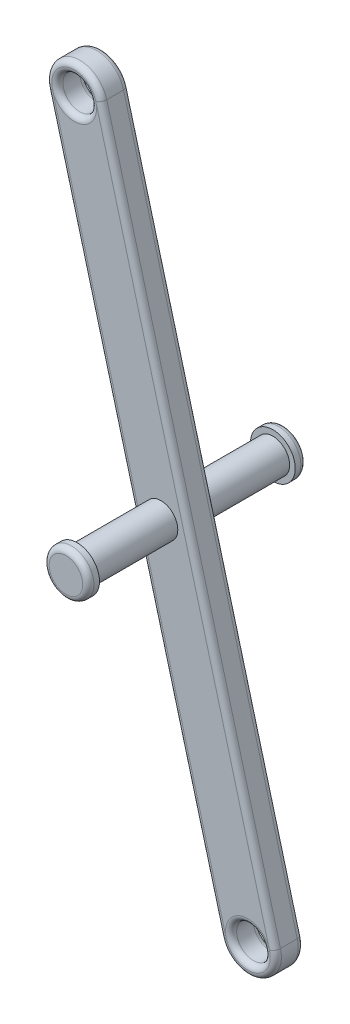
ISO-10303-21;
HEADER;
FILE_DESCRIPTION(('STEP AP214'),'2;1');
FILE_NAME('part.step','',(''),(''),'','','');
FILE_SCHEMA(('AUTOMOTIVE_DESIGN { 1 0 10303 214 1 1 1 1 }'));
ENDSEC;
DATA;
#1=APPLICATION_CONTEXT('core data for automotive mechanical design processes');
#2=APPLICATION_PROTOCOL_DEFINITION('international standard','automotive_design',2000,#1);
#3=PRODUCT_CONTEXT('',#1,'mechanical');
#4=PRODUCT('Part','Part','',(#3));
#5=PRODUCT_RELATED_PRODUCT_CATEGORY('part','',(#4));
#6=PRODUCT_DEFINITION_FORMATION('','',#4);
#7=PRODUCT_DEFINITION_CONTEXT('part definition',#1,'design');
#8=PRODUCT_DEFINITION('design','',#6,#7);
#9=PRODUCT_DEFINITION_SHAPE('','',#8);
#10=(LENGTH_UNIT() NAMED_UNIT(*) SI_UNIT(.MILLI.,.METRE.));
#11=(NAMED_UNIT(*) PLANE_ANGLE_UNIT() SI_UNIT($,.RADIAN.));
#12=(NAMED_UNIT(*) SI_UNIT($,.STERADIAN.) SOLID_ANGLE_UNIT());
#13=UNCERTAINTY_MEASURE_WITH_UNIT(LENGTH_MEASURE(1.E-05),#10,'distance_accuracy_value','');
#14=(GEOMETRIC_REPRESENTATION_CONTEXT(3) GLOBAL_UNCERTAINTY_ASSIGNED_CONTEXT((#13)) GLOBAL_UNIT_ASSIGNED_CONTEXT((#10,
#11,#12)) REPRESENTATION_CONTEXT('',''));
#15=CARTESIAN_POINT('',(0.,0.,0.));
#16=DIRECTION('',(0.,0.,1.));
#17=DIRECTION('',(1.,0.,0.));
#18=AXIS2_PLACEMENT_3D('',#15,#16,#17);
#19=CARTESIAN_POINT('',(27.373714942326,121.762953497462,2.5));
#20=DIRECTION('',(0.,0.,1.));
#21=DIRECTION('',(1.,0.,0.));
#22=AXIS2_PLACEMENT_3D('',#19,#20,#21);
#23=PLANE('',#22);
#24=CARTESIAN_POINT('',(35.1382862954018,92.7851787087896,2.5));
#25=DIRECTION('',(0.,0.,1.));
#26=DIRECTION('',(1.,0.,0.));
#27=AXIS2_PLACEMENT_3D('',#24,#25,#26);
#28=CIRCLE('',#27,1.5);
#29=CARTESIAN_POINT('',(36.6382862954018,92.7851787087896,2.5));
#30=VERTEX_POINT('',#29);
#31=EDGE_CURVE('E197',#30,#30,#28,.T.);
#32=ORIENTED_EDGE('',*,*,#31,.F.);
#33=EDGE_LOOP('',(#32));
#34=FACE_BOUND('',#33,.T.);
#35=DIRECTION('',(0.258819045102528,-0.965925826289067,0.));
#36=VECTOR('',#35,1.);
#37=CARTESIAN_POINT('',(40.9710059958995,63.2897658299125,2.5));
#38=LINE('',#37,#36);
#39=CARTESIAN_POINT('',(25.4418632897479,121.245315407256,2.5));
#40=VERTEX_POINT('',#39);
#41=CARTESIAN_POINT('',(40.9710059958995,63.2897658299125,2.5));
#42=VERTEX_POINT('',#41);
#43=EDGE_CURVE('E63',#40,#42,#38,.T.);
#44=ORIENTED_EDGE('',*,*,#43,.T.);
#45=CARTESIAN_POINT('',(42.9028576484777,63.8074039201176,2.5));
#46=DIRECTION('',(0.,0.,1.));
#47=DIRECTION('',(1.,0.,0.));
#48=AXIS2_PLACEMENT_3D('',#45,#46,#47);
#49=CIRCLE('',#48,2.);
#50=CARTESIAN_POINT('',(44.8347093010558,64.3250420103226,2.5));
#51=VERTEX_POINT('',#50);
#52=EDGE_CURVE('E195',#42,#51,#49,.F.);
#53=ORIENTED_EDGE('',*,*,#52,.T.);
#54=DIRECTION('',(-0.258819045102528,0.965925826289067,0.));
#55=VECTOR('',#54,1.);
#56=CARTESIAN_POINT('',(29.3055665949042,122.280591587667,2.5));
#57=LINE('',#56,#55);
#58=CARTESIAN_POINT('',(29.3055665949042,122.280591587667,2.5));
#59=VERTEX_POINT('',#58);
#60=EDGE_CURVE('E193',#51,#59,#57,.T.);
#61=ORIENTED_EDGE('',*,*,#60,.T.);
#62=CARTESIAN_POINT('',(27.373714942326,121.762953497462,2.5));
#63=DIRECTION('',(0.,0.,1.));
#64=DIRECTION('',(1.,0.,0.));
#65=AXIS2_PLACEMENT_3D('',#62,#63,#64);
#66=CIRCLE('',#65,2.00000000000001);
#67=CARTESIAN_POINT('',(29.373714942326,121.762953497462,2.5));
#68=VERTEX_POINT('',#67);
#69=EDGE_CURVE('E188',#59,#68,#66,.F.);
#70=ORIENTED_EDGE('',*,*,#69,.T.);
#71=CARTESIAN_POINT('',(27.373714942326,121.762953497462,2.5));
#72=DIRECTION('',(0.,0.,1.));
#73=DIRECTION('',(1.,0.,0.));
#74=AXIS2_PLACEMENT_3D('',#71,#72,#73);
#75=CIRCLE('',#74,2.00000000000001);
#76=EDGE_CURVE('E190',#68,#40,#75,.F.);
#77=ORIENTED_EDGE('',*,*,#76,.T.);
#78=EDGE_LOOP('',(#44,#53,#61,#70,#77));
#79=FACE_BOUND('',#78,.T.);
#80=ADVANCED_FACE('F41',(#34,#79),#23,.T.);
#81=CARTESIAN_POINT('',(27.373714942326,121.762953497462,0.));
#82=DIRECTION('',(0.,0.,1.));
#83=DIRECTION('',(1.,0.,0.));
#84=AXIS2_PLACEMENT_3D('',#81,#82,#83);
#85=PLANE('',#84);
#86=CARTESIAN_POINT('',(35.1382862954018,92.7851787087896,0.));
#87=DIRECTION('',(0.,0.,1.));
#88=DIRECTION('',(1.,0.,0.));
#89=AXIS2_PLACEMENT_3D('',#86,#87,#88);
#90=CIRCLE('',#89,1.5);
#91=CARTESIAN_POINT('',(36.6382862954018,92.7851787087896,0.));
#92=VERTEX_POINT('',#91);
#93=EDGE_CURVE('E207',#92,#92,#90,.T.);
#94=ORIENTED_EDGE('',*,*,#93,.T.);
#95=EDGE_LOOP('',(#94));
#96=FACE_BOUND('',#95,.T.);
#97=DIRECTION('',(0.258819045102528,-0.965925826289067,0.));
#98=VECTOR('',#97,1.);
#99=CARTESIAN_POINT('',(25.4418632897479,121.245315407257,0.));
#100=LINE('',#99,#98);
#101=CARTESIAN_POINT('',(40.9710059958995,63.2897658299125,0.));
#102=VERTEX_POINT('',#101);
#103=CARTESIAN_POINT('',(25.4418632897479,121.245315407256,0.));
#104=VERTEX_POINT('',#103);
#105=EDGE_CURVE('E156',#102,#104,#100,.F.);
#106=ORIENTED_EDGE('',*,*,#105,.T.);
#107=CARTESIAN_POINT('',(27.373714942326,121.762953497462,0.));
#108=DIRECTION('',(0.,0.,1.));
#109=DIRECTION('',(1.,0.,0.));
#110=AXIS2_PLACEMENT_3D('',#107,#108,#109);
#111=CIRCLE('',#110,2.00000000000001);
#112=CARTESIAN_POINT('',(29.373714942326,121.762953497462,0.));
#113=VERTEX_POINT('',#112);
#114=EDGE_CURVE('E121',#104,#113,#111,.T.);
#115=ORIENTED_EDGE('',*,*,#114,.T.);
#116=CARTESIAN_POINT('',(27.373714942326,121.762953497462,0.));
#117=DIRECTION('',(0.,0.,1.));
#118=DIRECTION('',(1.,0.,0.));
#119=AXIS2_PLACEMENT_3D('',#116,#117,#118);
#120=CIRCLE('',#119,2.00000000000001);
#121=CARTESIAN_POINT('',(29.3055665949041,122.280591587667,0.));
#122=VERTEX_POINT('',#121);
#123=EDGE_CURVE('E113',#113,#122,#120,.T.);
#124=ORIENTED_EDGE('',*,*,#123,.T.);
#125=DIRECTION('',(-0.258819045102528,0.965925826289067,0.));
#126=VECTOR('',#125,1.);
#127=CARTESIAN_POINT('',(29.3055665949041,122.280591587667,0.));
#128=LINE('',#127,#126);
#129=CARTESIAN_POINT('',(44.8347093010558,64.3250420103226,0.));
#130=VERTEX_POINT('',#129);
#131=EDGE_CURVE('E118',#122,#130,#128,.F.);
#132=ORIENTED_EDGE('',*,*,#131,.T.);
#133=CARTESIAN_POINT('',(42.9028576484777,63.8074039201176,0.));
#134=DIRECTION('',(0.,0.,1.));
#135=DIRECTION('',(1.,0.,0.));
#136=AXIS2_PLACEMENT_3D('',#133,#134,#135);
#137=CIRCLE('',#136,2.);
#138=EDGE_CURVE('E123',#130,#102,#137,.T.);
#139=ORIENTED_EDGE('',*,*,#138,.T.);
#140=EDGE_LOOP('',(#106,#115,#124,#132,#139));
#141=FACE_BOUND('',#140,.T.);
#142=ADVANCED_FACE('F115',(#96,#141),#85,.F.);
#143=CARTESIAN_POINT('',(27.373714942326,121.762953497462,2.5));
#144=DIRECTION('',(0.,0.,-1.));
#145=DIRECTION('',(-1.,0.,0.));
#146=AXIS2_PLACEMENT_3D('',#143,#144,#145);
#147=CYLINDRICAL_SURFACE('',#146,2.5);
#148=DIRECTION('',(0.,0.,-1.));
#149=VECTOR('',#148,1.);
#150=CARTESIAN_POINT('',(29.7885295080487,122.410001110218,2.5));
#151=LINE('',#150,#149);
#152=CARTESIAN_POINT('',(29.7885295080487,122.410001110218,2.));
#153=VERTEX_POINT('',#152);
#154=CARTESIAN_POINT('',(29.7885295080487,122.410001110218,0.5));
#155=VERTEX_POINT('',#154);
#156=EDGE_CURVE('E132',#153,#155,#151,.T.);
#157=ORIENTED_EDGE('',*,*,#156,.T.);
#158=CARTESIAN_POINT('',(27.373714942326,121.762953497462,0.5));
#159=DIRECTION('',(0.,0.,1.));
#160=DIRECTION('',(1.,0.,0.));
#161=AXIS2_PLACEMENT_3D('',#158,#159,#160);
#162=CIRCLE('',#161,2.5);
#163=CARTESIAN_POINT('',(24.9589003766033,121.115905884705,0.5));
#164=VERTEX_POINT('',#163);
#165=EDGE_CURVE('E139',#155,#164,#162,.T.);
#166=ORIENTED_EDGE('',*,*,#165,.T.);
#167=DIRECTION('',(0.,0.,-1.));
#168=VECTOR('',#167,1.);
#169=CARTESIAN_POINT('',(24.9589003766033,121.115905884705,2.5));
#170=LINE('',#169,#168);
#171=CARTESIAN_POINT('',(24.9589003766033,121.115905884705,2.));
#172=VERTEX_POINT('',#171);
#173=EDGE_CURVE('E148',#172,#164,#170,.T.);
#174=ORIENTED_EDGE('',*,*,#173,.F.);
#175=CARTESIAN_POINT('',(27.373714942326,121.762953497462,2.));
#176=DIRECTION('',(0.,0.,1.));
#177=DIRECTION('',(1.,0.,0.));
#178=AXIS2_PLACEMENT_3D('',#175,#176,#177);
#179=CIRCLE('',#178,2.5);
#180=EDGE_CURVE('E185',#172,#153,#179,.F.);
#181=ORIENTED_EDGE('',*,*,#180,.T.);
#182=EDGE_LOOP('',(#157,#166,#174,#181));
#183=FACE_BOUND('',#182,.T.);
#184=ADVANCED_FACE('F249',(#183),#147,.T.);
#185=CARTESIAN_POINT('',(24.9589003766033,121.115905884705,2.5));
#186=DIRECTION('',(0.965925826289067,0.258819045102528,0.));
#187=DIRECTION('',(-0.258819045102528,0.965925826289067,0.));
#188=AXIS2_PLACEMENT_3D('',#185,#186,#187);
#189=PLANE('',#188);
#190=ORIENTED_EDGE('',*,*,#173,.T.);
#191=DIRECTION('',(0.258819045102528,-0.965925826289067,0.));
#192=VECTOR('',#191,1.);
#193=CARTESIAN_POINT('',(24.9589003766033,121.115905884705,0.5));
#194=LINE('',#193,#192);
#195=CARTESIAN_POINT('',(40.488043082755,63.1603563073612,0.5));
#196=VERTEX_POINT('',#195);
#197=EDGE_CURVE('E173',#164,#196,#194,.T.);
#198=ORIENTED_EDGE('',*,*,#197,.T.);
#199=DIRECTION('',(0.,0.,-1.));
#200=VECTOR('',#199,1.);
#201=CARTESIAN_POINT('',(40.488043082755,63.1603563073612,2.5));
#202=LINE('',#201,#200);
#203=CARTESIAN_POINT('',(40.488043082755,63.1603563073612,2.));
#204=VERTEX_POINT('',#203);
#205=EDGE_CURVE('E151',#204,#196,#202,.T.);
#206=ORIENTED_EDGE('',*,*,#205,.F.);
#207=DIRECTION('',(0.258819045102528,-0.965925826289067,0.));
#208=VECTOR('',#207,1.);
#209=CARTESIAN_POINT('',(24.9589003766033,121.115905884705,2.));
#210=LINE('',#209,#208);
#211=EDGE_CURVE('E171',#204,#172,#210,.F.);
#212=ORIENTED_EDGE('',*,*,#211,.T.);
#213=EDGE_LOOP('',(#190,#198,#206,#212));
#214=FACE_BOUND('',#213,.T.);
#215=ADVANCED_FACE('F264',(#214),#189,.F.);
#216=CARTESIAN_POINT('',(42.9028576484777,63.8074039201176,2.5));
#217=DIRECTION('',(0.,0.,-1.));
#218=DIRECTION('',(-1.,0.,0.));
#219=AXIS2_PLACEMENT_3D('',#216,#217,#218);
#220=CYLINDRICAL_SURFACE('',#219,2.50000000000002);
#221=ORIENTED_EDGE('',*,*,#205,.T.);
#222=CARTESIAN_POINT('',(42.9028576484777,63.8074039201176,0.5));
#223=DIRECTION('',(0.,0.,1.));
#224=DIRECTION('',(1.,0.,0.));
#225=AXIS2_PLACEMENT_3D('',#222,#223,#224);
#226=CIRCLE('',#225,2.50000000000002);
#227=CARTESIAN_POINT('',(45.3176722142004,64.4544515328739,0.5));
#228=VERTEX_POINT('',#227);
#229=EDGE_CURVE('E178',#196,#228,#226,.T.);
#230=ORIENTED_EDGE('',*,*,#229,.T.);
#231=DIRECTION('',(0.,0.,-1.));
#232=VECTOR('',#231,1.);
#233=CARTESIAN_POINT('',(45.3176722142004,64.4544515328739,2.5));
#234=LINE('',#233,#232);
#235=CARTESIAN_POINT('',(45.3176722142004,64.4544515328739,2.));
#236=VERTEX_POINT('',#235);
#237=EDGE_CURVE('E332',#236,#228,#234,.T.);
#238=ORIENTED_EDGE('',*,*,#237,.F.);
#239=CARTESIAN_POINT('',(42.9028576484777,63.8074039201176,2.));
#240=DIRECTION('',(0.,0.,1.));
#241=DIRECTION('',(1.,0.,0.));
#242=AXIS2_PLACEMENT_3D('',#239,#240,#241);
#243=CIRCLE('',#242,2.50000000000002);
#244=EDGE_CURVE('E176',#236,#204,#243,.F.);
#245=ORIENTED_EDGE('',*,*,#244,.T.);
#246=EDGE_LOOP('',(#221,#230,#238,#245));
#247=FACE_BOUND('',#246,.T.);
#248=ADVANCED_FACE('F260',(#247),#220,.T.);
#249=CARTESIAN_POINT('',(29.7885295080487,122.410001110218,2.5));
#250=DIRECTION('',(-0.965925826289066,-0.258819045102528,0.));
#251=DIRECTION('',(0.258819045102528,-0.965925826289067,0.));
#252=AXIS2_PLACEMENT_3D('',#249,#250,#251);
#253=PLANE('',#252);
#254=ORIENTED_EDGE('',*,*,#237,.T.);
#255=DIRECTION('',(-0.258819045102528,0.965925826289067,0.));
#256=VECTOR('',#255,1.);
#257=CARTESIAN_POINT('',(29.7885295080487,122.410001110218,0.5));
#258=LINE('',#257,#256);
#259=EDGE_CURVE('E183',#228,#155,#258,.T.);
#260=ORIENTED_EDGE('',*,*,#259,.T.);
#261=ORIENTED_EDGE('',*,*,#156,.F.);
#262=DIRECTION('',(-0.258819045102528,0.965925826289067,0.));
#263=VECTOR('',#262,1.);
#264=CARTESIAN_POINT('',(45.3176722142004,64.4544515328739,2.));
#265=LINE('',#264,#263);
#266=EDGE_CURVE('E180',#153,#236,#265,.F.);
#267=ORIENTED_EDGE('',*,*,#266,.T.);
#268=EDGE_LOOP('',(#254,#260,#261,#267));
#269=FACE_BOUND('',#268,.T.);
#270=ADVANCED_FACE('F257',(#269),#253,.F.);
#271=CARTESIAN_POINT('',(27.373714942326,121.762953497462,2.5));
#272=DIRECTION('',(0.,0.,-1.));
#273=DIRECTION('',(-1.,0.,0.));
#274=AXIS2_PLACEMENT_3D('',#271,#272,#273);
#275=CYLINDRICAL_SURFACE('',#274,1.50000000000001);
#276=CARTESIAN_POINT('',(27.373714942326,121.762953497462,0.5));
#277=DIRECTION('',(0.,0.,1.));
#278=DIRECTION('',(1.,0.,0.));
#279=AXIS2_PLACEMENT_3D('',#276,#277,#278);
#280=CIRCLE('',#279,1.50000000000001);
#281=CARTESIAN_POINT('',(28.873714942326,121.762953497462,0.5));
#282=VERTEX_POINT('',#281);
#283=EDGE_CURVE('E168',#282,#282,#280,.F.);
#284=ORIENTED_EDGE('',*,*,#283,.T.);
#285=EDGE_LOOP('',(#284));
#286=FACE_BOUND('',#285,.T.);
#287=CARTESIAN_POINT('',(27.373714942326,121.762953497462,2.));
#288=DIRECTION('',(0.,0.,1.));
#289=DIRECTION('',(1.,0.,0.));
#290=AXIS2_PLACEMENT_3D('',#287,#288,#289);
#291=CIRCLE('',#290,1.50000000000001);
#292=CARTESIAN_POINT('',(28.873714942326,121.762953497462,2.));
#293=VERTEX_POINT('',#292);
#294=EDGE_CURVE('E165',#293,#293,#291,.T.);
#295=ORIENTED_EDGE('',*,*,#294,.T.);
#296=EDGE_LOOP('',(#295));
#297=FACE_BOUND('',#296,.T.);
#298=ADVANCED_FACE('F254',(#286,#297),#275,.F.);
#299=CARTESIAN_POINT('',(42.9028576484777,63.8074039201176,2.5));
#300=DIRECTION('',(0.,0.,-1.));
#301=DIRECTION('',(-1.,0.,0.));
#302=AXIS2_PLACEMENT_3D('',#299,#300,#301);
#303=CYLINDRICAL_SURFACE('',#302,1.5);
#304=CARTESIAN_POINT('',(42.9028576484777,63.8074039201176,0.5));
#305=DIRECTION('',(0.,0.,1.));
#306=DIRECTION('',(1.,0.,0.));
#307=AXIS2_PLACEMENT_3D('',#304,#305,#306);
#308=CIRCLE('',#307,1.5);
#309=CARTESIAN_POINT('',(44.4028576484777,63.8074039201176,0.5));
#310=VERTEX_POINT('',#309);
#311=EDGE_CURVE('E162',#310,#310,#308,.F.);
#312=ORIENTED_EDGE('',*,*,#311,.T.);
#313=EDGE_LOOP('',(#312));
#314=FACE_BOUND('',#313,.T.);
#315=CARTESIAN_POINT('',(42.9028576484777,63.8074039201176,2.));
#316=DIRECTION('',(0.,0.,1.));
#317=DIRECTION('',(1.,0.,0.));
#318=AXIS2_PLACEMENT_3D('',#315,#316,#317);
#319=CIRCLE('',#318,1.5);
#320=CARTESIAN_POINT('',(44.4028576484777,63.8074039201176,2.));
#321=VERTEX_POINT('',#320);
#322=EDGE_CURVE('E159',#321,#321,#319,.T.);
#323=ORIENTED_EDGE('',*,*,#322,.T.);
#324=EDGE_LOOP('',(#323));
#325=FACE_BOUND('',#324,.T.);
#326=ADVANCED_FACE('F291',(#314,#325),#303,.F.);
#327=CARTESIAN_POINT('',(27.373714942326,121.762953497462,0.5));
#328=DIRECTION('',(0.,0.,1.));
#329=DIRECTION('',(1.,0.,0.));
#330=AXIS2_PLACEMENT_3D('',#327,#328,#329);
#331=TOROIDAL_SURFACE('',#330,2.00000000000001,0.5);
#332=ORIENTED_EDGE('',*,*,#283,.F.);
#333=EDGE_LOOP('',(#332));
#334=FACE_BOUND('',#333,.T.);
#335=CARTESIAN_POINT('',(27.373714942326,121.762953497462,0.));
#336=DIRECTION('',(0.,0.,1.));
#337=DIRECTION('',(1.,0.,0.));
#338=AXIS2_PLACEMENT_3D('',#335,#336,#337);
#339=CIRCLE('',#338,2.00000000000001);
#340=EDGE_CURVE('E126',#122,#104,#339,.T.);
#341=ORIENTED_EDGE('',*,*,#340,.F.);
#342=ORIENTED_EDGE('',*,*,#123,.F.);
#343=ORIENTED_EDGE('',*,*,#114,.F.);
#344=EDGE_LOOP('',(#341,#342,#343));
#345=FACE_BOUND('',#344,.T.);
#346=ADVANCED_FACE('F128',(#334,#345),#331,.T.);
#347=CARTESIAN_POINT('',(27.373714942326,121.762953497462,0.5));
#348=DIRECTION('',(0.,0.,1.));
#349=DIRECTION('',(1.,0.,0.));
#350=AXIS2_PLACEMENT_3D('',#347,#348,#349);
#351=TOROIDAL_SURFACE('',#350,2.,0.5);
#352=CARTESIAN_POINT('',(29.3055665949042,122.280591587667,0.5));
#353=DIRECTION('',(0.258819045102527,-0.965925826289067,0.));
#354=DIRECTION('',(0.965925826289067,0.258819045102527,0.));
#355=AXIS2_PLACEMENT_3D('',#352,#353,#354);
#356=CIRCLE('',#355,0.5);
#357=EDGE_CURVE('E137',#122,#155,#356,.T.);
#358=ORIENTED_EDGE('',*,*,#357,.F.);
#359=ORIENTED_EDGE('',*,*,#340,.T.);
#360=CARTESIAN_POINT('',(25.4418632897479,121.245315407256,0.5));
#361=DIRECTION('',(0.258819045102527,-0.965925826289067,0.));
#362=DIRECTION('',(0.965925826289067,0.258819045102527,0.));
#363=AXIS2_PLACEMENT_3D('',#360,#361,#362);
#364=CIRCLE('',#363,0.5);
#365=EDGE_CURVE('E133',#164,#104,#364,.T.);
#366=ORIENTED_EDGE('',*,*,#365,.F.);
#367=ORIENTED_EDGE('',*,*,#165,.F.);
#368=EDGE_LOOP('',(#358,#359,#366,#367));
#369=FACE_BOUND('',#368,.T.);
#370=ADVANCED_FACE('F138',(#369),#351,.T.);
#371=CARTESIAN_POINT('',(25.4418632897479,121.245315407256,0.5));
#372=DIRECTION('',(0.258819045102528,-0.965925826289067,0.));
#373=DIRECTION('',(0.965925826289067,0.258819045102528,0.));
#374=AXIS2_PLACEMENT_3D('',#371,#372,#373);
#375=CYLINDRICAL_SURFACE('',#374,0.5);
#376=ORIENTED_EDGE('',*,*,#365,.T.);
#377=ORIENTED_EDGE('',*,*,#105,.F.);
#378=CARTESIAN_POINT('',(40.9710059958995,63.2897658299125,0.5));
#379=DIRECTION('',(0.258819045102525,-0.965925826289067,0.));
#380=DIRECTION('',(0.965925826289067,0.258819045102525,0.));
#381=AXIS2_PLACEMENT_3D('',#378,#379,#380);
#382=CIRCLE('',#381,0.5);
#383=EDGE_CURVE('E142',#196,#102,#382,.T.);
#384=ORIENTED_EDGE('',*,*,#383,.F.);
#385=ORIENTED_EDGE('',*,*,#197,.F.);
#386=EDGE_LOOP('',(#376,#377,#384,#385));
#387=FACE_BOUND('',#386,.T.);
#388=ADVANCED_FACE('F283',(#387),#375,.T.);
#389=CARTESIAN_POINT('',(29.3055665949042,122.280591587667,0.5));
#390=DIRECTION('',(-0.258819045102528,0.965925826289067,0.));
#391=DIRECTION('',(-0.965925826289066,-0.258819045102528,0.));
#392=AXIS2_PLACEMENT_3D('',#389,#390,#391);
#393=CYLINDRICAL_SURFACE('',#392,0.5);
#394=ORIENTED_EDGE('',*,*,#357,.T.);
#395=ORIENTED_EDGE('',*,*,#259,.F.);
#396=CARTESIAN_POINT('',(44.8347093010558,64.3250420103226,0.5));
#397=DIRECTION('',(0.258819045102525,-0.965925826289067,0.));
#398=DIRECTION('',(0.965925826289067,0.258819045102525,0.));
#399=AXIS2_PLACEMENT_3D('',#396,#397,#398);
#400=CIRCLE('',#399,0.5);
#401=EDGE_CURVE('E146',#130,#228,#400,.T.);
#402=ORIENTED_EDGE('',*,*,#401,.F.);
#403=ORIENTED_EDGE('',*,*,#131,.F.);
#404=EDGE_LOOP('',(#394,#395,#402,#403));
#405=FACE_BOUND('',#404,.T.);
#406=ADVANCED_FACE('F144',(#405),#393,.T.);
#407=CARTESIAN_POINT('',(42.9028576484777,63.8074039201176,0.5));
#408=DIRECTION('',(0.,0.,1.));
#409=DIRECTION('',(1.,0.,0.));
#410=AXIS2_PLACEMENT_3D('',#407,#408,#409);
#411=TOROIDAL_SURFACE('',#410,2.00000000000002,0.5);
#412=CARTESIAN_POINT('',(42.9028576484777,63.8074039201176,0.));
#413=DIRECTION('',(0.,0.,1.));
#414=DIRECTION('',(1.,0.,0.));
#415=AXIS2_PLACEMENT_3D('',#412,#413,#414);
#416=CIRCLE('',#415,2.00000000000002);
#417=EDGE_CURVE('E198',#130,#102,#416,.F.);
#418=ORIENTED_EDGE('',*,*,#417,.F.);
#419=ORIENTED_EDGE('',*,*,#401,.T.);
#420=ORIENTED_EDGE('',*,*,#229,.F.);
#421=ORIENTED_EDGE('',*,*,#383,.T.);
#422=EDGE_LOOP('',(#418,#419,#420,#421));
#423=FACE_BOUND('',#422,.T.);
#424=ADVANCED_FACE('F276',(#423),#411,.T.);
#425=CARTESIAN_POINT('',(42.9028576484777,63.8074039201176,0.5));
#426=DIRECTION('',(0.,0.,1.));
#427=DIRECTION('',(1.,0.,0.));
#428=AXIS2_PLACEMENT_3D('',#425,#426,#427);
#429=TOROIDAL_SURFACE('',#428,2.,0.5);
#430=ORIENTED_EDGE('',*,*,#311,.F.);
#431=EDGE_LOOP('',(#430));
#432=FACE_BOUND('',#431,.T.);
#433=ORIENTED_EDGE('',*,*,#138,.F.);
#434=ORIENTED_EDGE('',*,*,#417,.T.);
#435=EDGE_LOOP('',(#433,#434));
#436=FACE_BOUND('',#435,.T.);
#437=ADVANCED_FACE('F272',(#432,#436),#429,.T.);
#438=CARTESIAN_POINT('',(27.373714942326,121.762953497462,2.));
#439=DIRECTION('',(0.,0.,1.));
#440=DIRECTION('',(1.,0.,0.));
#441=AXIS2_PLACEMENT_3D('',#438,#439,#440);
#442=TOROIDAL_SURFACE('',#441,2.00000000000001,0.5);
#443=ORIENTED_EDGE('',*,*,#294,.F.);
#444=EDGE_LOOP('',(#443));
#445=FACE_BOUND('',#444,.T.);
#446=CARTESIAN_POINT('',(27.373714942326,121.762953497462,2.5));
#447=DIRECTION('',(0.,0.,1.));
#448=DIRECTION('',(1.,0.,0.));
#449=AXIS2_PLACEMENT_3D('',#446,#447,#448);
#450=CIRCLE('',#449,2.00000000000001);
#451=EDGE_CURVE('E200',#40,#59,#450,.F.);
#452=ORIENTED_EDGE('',*,*,#451,.F.);
#453=ORIENTED_EDGE('',*,*,#76,.F.);
#454=ORIENTED_EDGE('',*,*,#69,.F.);
#455=EDGE_LOOP('',(#452,#453,#454));
#456=FACE_BOUND('',#455,.T.);
#457=ADVANCED_FACE('F275',(#445,#456),#442,.T.);
#458=CARTESIAN_POINT('',(27.373714942326,121.762953497462,2.));
#459=DIRECTION('',(0.,0.,1.));
#460=DIRECTION('',(1.,0.,0.));
#461=AXIS2_PLACEMENT_3D('',#458,#459,#460);
#462=TOROIDAL_SURFACE('',#461,2.,0.5);
#463=CARTESIAN_POINT('',(25.4418632897479,121.245315407256,2.));
#464=DIRECTION('',(0.258819045102527,-0.965925826289067,0.));
#465=DIRECTION('',(0.965925826289067,0.258819045102527,0.));
#466=AXIS2_PLACEMENT_3D('',#463,#464,#465);
#467=CIRCLE('',#466,0.5);
#468=EDGE_CURVE('E212',#40,#172,#467,.T.);
#469=ORIENTED_EDGE('',*,*,#468,.F.);
#470=ORIENTED_EDGE('',*,*,#451,.T.);
#471=CARTESIAN_POINT('',(29.3055665949042,122.280591587667,2.));
#472=DIRECTION('',(0.258819045102527,-0.965925826289067,0.));
#473=DIRECTION('',(0.965925826289067,0.258819045102527,0.));
#474=AXIS2_PLACEMENT_3D('',#471,#472,#473);
#475=CIRCLE('',#474,0.5);
#476=EDGE_CURVE('E215',#153,#59,#475,.T.);
#477=ORIENTED_EDGE('',*,*,#476,.F.);
#478=ORIENTED_EDGE('',*,*,#180,.F.);
#479=EDGE_LOOP('',(#469,#470,#477,#478));
#480=FACE_BOUND('',#479,.T.);
#481=ADVANCED_FACE('F307',(#480),#462,.T.);
#482=CARTESIAN_POINT('',(29.3055665949042,122.280591587667,2.));
#483=DIRECTION('',(0.258819045102528,-0.965925826289067,0.));
#484=DIRECTION('',(0.965925826289066,0.258819045102528,0.));
#485=AXIS2_PLACEMENT_3D('',#482,#483,#484);
#486=CYLINDRICAL_SURFACE('',#485,0.5);
#487=ORIENTED_EDGE('',*,*,#476,.T.);
#488=ORIENTED_EDGE('',*,*,#60,.F.);
#489=CARTESIAN_POINT('',(44.8347093010558,64.3250420103226,2.));
#490=DIRECTION('',(0.258819045102525,-0.965925826289067,0.));
#491=DIRECTION('',(0.965925826289067,0.258819045102525,0.));
#492=AXIS2_PLACEMENT_3D('',#489,#490,#491);
#493=CIRCLE('',#492,0.5);
#494=EDGE_CURVE('E210',#236,#51,#493,.T.);
#495=ORIENTED_EDGE('',*,*,#494,.F.);
#496=ORIENTED_EDGE('',*,*,#266,.F.);
#497=EDGE_LOOP('',(#487,#488,#495,#496));
#498=FACE_BOUND('',#497,.T.);
#499=ADVANCED_FACE('F303',(#498),#486,.T.);
#500=CARTESIAN_POINT('',(25.4418632897479,121.245315407257,2.));
#501=DIRECTION('',(-0.258819045102528,0.965925826289067,0.));
#502=DIRECTION('',(-0.965925826289067,-0.258819045102528,0.));
#503=AXIS2_PLACEMENT_3D('',#500,#501,#502);
#504=CYLINDRICAL_SURFACE('',#503,0.5);
#505=ORIENTED_EDGE('',*,*,#468,.T.);
#506=ORIENTED_EDGE('',*,*,#211,.F.);
#507=CARTESIAN_POINT('',(40.9710059958995,63.2897658299125,2.));
#508=DIRECTION('',(0.258819045102525,-0.965925826289067,0.));
#509=DIRECTION('',(0.965925826289067,0.258819045102525,0.));
#510=AXIS2_PLACEMENT_3D('',#507,#508,#509);
#511=CIRCLE('',#510,0.5);
#512=EDGE_CURVE('E206',#42,#204,#511,.T.);
#513=ORIENTED_EDGE('',*,*,#512,.F.);
#514=ORIENTED_EDGE('',*,*,#43,.F.);
#515=EDGE_LOOP('',(#505,#506,#513,#514));
#516=FACE_BOUND('',#515,.T.);
#517=ADVANCED_FACE('F299',(#516),#504,.T.);
#518=CARTESIAN_POINT('',(42.9028576484777,63.8074039201176,2.));
#519=DIRECTION('',(0.,0.,1.));
#520=DIRECTION('',(1.,0.,0.));
#521=AXIS2_PLACEMENT_3D('',#518,#519,#520);
#522=TOROIDAL_SURFACE('',#521,2.00000000000002,0.5);
#523=CARTESIAN_POINT('',(42.9028576484777,63.8074039201176,2.5));
#524=DIRECTION('',(0.,0.,1.));
#525=DIRECTION('',(1.,0.,0.));
#526=AXIS2_PLACEMENT_3D('',#523,#524,#525);
#527=CIRCLE('',#526,2.00000000000002);
#528=EDGE_CURVE('E55',#42,#51,#527,.T.);
#529=ORIENTED_EDGE('',*,*,#528,.F.);
#530=ORIENTED_EDGE('',*,*,#512,.T.);
#531=ORIENTED_EDGE('',*,*,#244,.F.);
#532=ORIENTED_EDGE('',*,*,#494,.T.);
#533=EDGE_LOOP('',(#529,#530,#531,#532));
#534=FACE_BOUND('',#533,.T.);
#535=ADVANCED_FACE('F296',(#534),#522,.T.);
#536=CARTESIAN_POINT('',(42.9028576484777,63.8074039201176,2.));
#537=DIRECTION('',(0.,0.,1.));
#538=DIRECTION('',(1.,0.,0.));
#539=AXIS2_PLACEMENT_3D('',#536,#537,#538);
#540=TOROIDAL_SURFACE('',#539,2.,0.5);
#541=ORIENTED_EDGE('',*,*,#52,.F.);
#542=ORIENTED_EDGE('',*,*,#528,.T.);
#543=EDGE_LOOP('',(#541,#542));
#544=FACE_BOUND('',#543,.T.);
#545=ORIENTED_EDGE('',*,*,#322,.F.);
#546=EDGE_LOOP('',(#545));
#547=FACE_BOUND('',#546,.T.);
#548=ADVANCED_FACE('F293',(#544,#547),#540,.T.);
#549=CARTESIAN_POINT('',(35.1382862954018,92.7851787087896,-7.5));
#550=DIRECTION('',(0.,0.,1.));
#551=DIRECTION('',(1.,0.,0.));
#552=AXIS2_PLACEMENT_3D('',#549,#550,#551);
#553=CYLINDRICAL_SURFACE('',#552,1.5);
#554=CARTESIAN_POINT('',(35.1382862954018,92.7851787087896,-7.5));
#555=DIRECTION('',(0.,0.,1.));
#556=DIRECTION('',(1.,0.,0.));
#557=AXIS2_PLACEMENT_3D('',#554,#555,#556);
#558=CIRCLE('',#557,1.5);
#559=CARTESIAN_POINT('',(36.6382862954018,92.7851787087896,-7.5));
#560=VERTEX_POINT('',#559);
#561=EDGE_CURVE('E341',#560,#560,#558,.T.);
#562=ORIENTED_EDGE('',*,*,#561,.T.);
#563=EDGE_LOOP('',(#562));
#564=FACE_BOUND('',#563,.T.);
#565=ORIENTED_EDGE('',*,*,#93,.F.);
#566=EDGE_LOOP('',(#565));
#567=FACE_BOUND('',#566,.T.);
#568=ADVANCED_FACE('F295',(#564,#567),#553,.T.);
#569=ORIENTED_EDGE('',*,*,#31,.T.);
#570=EDGE_LOOP('',(#569));
#571=FACE_BOUND('',#570,.T.);
#572=CARTESIAN_POINT('',(35.1382862954018,92.7851787087896,10.));
#573=DIRECTION('',(0.,0.,1.));
#574=DIRECTION('',(1.,0.,0.));
#575=AXIS2_PLACEMENT_3D('',#572,#573,#574);
#576=CIRCLE('',#575,1.5);
#577=CARTESIAN_POINT('',(36.6382862954018,92.7851787087896,10.));
#578=VERTEX_POINT('',#577);
#579=EDGE_CURVE('E222',#578,#578,#576,.T.);
#580=ORIENTED_EDGE('',*,*,#579,.F.);
#581=EDGE_LOOP('',(#580));
#582=FACE_BOUND('',#581,.T.);
#583=ADVANCED_FACE('F378',(#571,#582),#553,.T.);
#584=CARTESIAN_POINT('',(35.1382862954018,92.7851787087896,11.));
#585=DIRECTION('',(0.,0.,-1.));
#586=DIRECTION('',(-1.,0.,0.));
#587=AXIS2_PLACEMENT_3D('',#584,#585,#586);
#588=CYLINDRICAL_SURFACE('',#587,2.);
#589=CARTESIAN_POINT('',(35.1382862954018,92.7851787087896,10.5));
#590=DIRECTION('',(0.,0.,1.));
#591=DIRECTION('',(1.,0.,0.));
#592=AXIS2_PLACEMENT_3D('',#589,#590,#591);
#593=CIRCLE('',#592,2.);
#594=CARTESIAN_POINT('',(37.1382862954018,92.7851787087896,10.5));
#595=VERTEX_POINT('',#594);
#596=EDGE_CURVE('E226',#595,#595,#593,.F.);
#597=ORIENTED_EDGE('',*,*,#596,.T.);
#598=EDGE_LOOP('',(#597));
#599=FACE_BOUND('',#598,.T.);
#600=CARTESIAN_POINT('',(35.1382862954018,92.7851787087896,10.));
#601=DIRECTION('',(0.,0.,1.));
#602=DIRECTION('',(1.,0.,0.));
#603=AXIS2_PLACEMENT_3D('',#600,#601,#602);
#604=CIRCLE('',#603,2.);
#605=CARTESIAN_POINT('',(37.1382862954018,92.7851787087896,10.));
#606=VERTEX_POINT('',#605);
#607=EDGE_CURVE('E344',#606,#606,#604,.T.);
#608=ORIENTED_EDGE('',*,*,#607,.T.);
#609=EDGE_LOOP('',(#608));
#610=FACE_BOUND('',#609,.T.);
#611=ADVANCED_FACE('F373',(#599,#610),#588,.T.);
#612=CARTESIAN_POINT('',(35.1382862954018,92.7851787087896,11.));
#613=DIRECTION('',(0.,0.,1.));
#614=DIRECTION('',(1.,0.,0.));
#615=AXIS2_PLACEMENT_3D('',#612,#613,#614);
#616=PLANE('',#615);
#617=CARTESIAN_POINT('',(35.1382862954018,92.7851787087896,11.));
#618=DIRECTION('',(0.,0.,1.));
#619=DIRECTION('',(1.,0.,0.));
#620=AXIS2_PLACEMENT_3D('',#617,#618,#619);
#621=CIRCLE('',#620,1.5);
#622=CARTESIAN_POINT('',(36.6382862954018,92.7851787087896,11.));
#623=VERTEX_POINT('',#622);
#624=EDGE_CURVE('E223',#623,#623,#621,.T.);
#625=ORIENTED_EDGE('',*,*,#624,.T.);
#626=EDGE_LOOP('',(#625));
#627=FACE_BOUND('',#626,.T.);
#628=ADVANCED_FACE('F370',(#627),#616,.T.);
#629=CARTESIAN_POINT('',(35.1382862954018,92.7851787087896,10.));
#630=DIRECTION('',(0.,0.,1.));
#631=DIRECTION('',(1.,0.,0.));
#632=AXIS2_PLACEMENT_3D('',#629,#630,#631);
#633=PLANE('',#632);
#634=ORIENTED_EDGE('',*,*,#579,.T.);
#635=EDGE_LOOP('',(#634));
#636=FACE_BOUND('',#635,.T.);
#637=ORIENTED_EDGE('',*,*,#607,.F.);
#638=EDGE_LOOP('',(#637));
#639=FACE_BOUND('',#638,.T.);
#640=ADVANCED_FACE('F368',(#636,#639),#633,.F.);
#641=CARTESIAN_POINT('',(35.1382862954018,92.7851787087896,-8.5));
#642=DIRECTION('',(0.,0.,1.));
#643=DIRECTION('',(1.,0.,0.));
#644=AXIS2_PLACEMENT_3D('',#641,#642,#643);
#645=CYLINDRICAL_SURFACE('',#644,2.);
#646=CARTESIAN_POINT('',(35.1382862954018,92.7851787087896,-8.));
#647=DIRECTION('',(0.,0.,-1.));
#648=DIRECTION('',(-1.,0.,0.));
#649=AXIS2_PLACEMENT_3D('',#646,#647,#648);
#650=CIRCLE('',#649,2.);
#651=CARTESIAN_POINT('',(33.1382862954018,92.7851787087896,-8.));
#652=VERTEX_POINT('',#651);
#653=EDGE_CURVE('E11',#652,#652,#650,.F.);
#654=ORIENTED_EDGE('',*,*,#653,.T.);
#655=EDGE_LOOP('',(#654));
#656=FACE_BOUND('',#655,.T.);
#657=CARTESIAN_POINT('',(35.1382862954018,92.7851787087896,-7.5));
#658=DIRECTION('',(0.,0.,-1.));
#659=DIRECTION('',(-1.,0.,0.));
#660=AXIS2_PLACEMENT_3D('',#657,#658,#659);
#661=CIRCLE('',#660,2.);
#662=CARTESIAN_POINT('',(33.1382862954018,92.7851787087896,-7.5));
#663=VERTEX_POINT('',#662);
#664=EDGE_CURVE('E345',#663,#663,#661,.T.);
#665=ORIENTED_EDGE('',*,*,#664,.T.);
#666=EDGE_LOOP('',(#665));
#667=FACE_BOUND('',#666,.T.);
#668=ADVANCED_FACE('F353',(#656,#667),#645,.T.);
#669=CARTESIAN_POINT('',(35.1382862954018,92.7851787087896,-8.5));
#670=DIRECTION('',(0.,0.,-1.));
#671=DIRECTION('',(-1.,0.,0.));
#672=AXIS2_PLACEMENT_3D('',#669,#670,#671);
#673=PLANE('',#672);
#674=CARTESIAN_POINT('',(35.1382862954018,92.7851787087896,-8.5));
#675=DIRECTION('',(0.,0.,-1.));
#676=DIRECTION('',(-1.,0.,0.));
#677=AXIS2_PLACEMENT_3D('',#674,#675,#676);
#678=CIRCLE('',#677,1.5);
#679=CARTESIAN_POINT('',(33.6382862954018,92.7851787087896,-8.5));
#680=VERTEX_POINT('',#679);
#681=EDGE_CURVE('E49',#680,#680,#678,.T.);
#682=ORIENTED_EDGE('',*,*,#681,.T.);
#683=EDGE_LOOP('',(#682));
#684=FACE_BOUND('',#683,.T.);
#685=ADVANCED_FACE('F231',(#684),#673,.T.);
#686=CARTESIAN_POINT('',(35.1382862954018,92.7851787087896,-7.5));
#687=DIRECTION('',(0.,0.,-1.));
#688=DIRECTION('',(-1.,0.,0.));
#689=AXIS2_PLACEMENT_3D('',#686,#687,#688);
#690=PLANE('',#689);
#691=ORIENTED_EDGE('',*,*,#561,.F.);
#692=EDGE_LOOP('',(#691));
#693=FACE_BOUND('',#692,.T.);
#694=ORIENTED_EDGE('',*,*,#664,.F.);
#695=EDGE_LOOP('',(#694));
#696=FACE_BOUND('',#695,.T.);
#697=ADVANCED_FACE('F239',(#693,#696),#690,.F.);
#698=CARTESIAN_POINT('',(35.1382862954018,92.7851787087896,10.5));
#699=DIRECTION('',(0.,0.,1.));
#700=DIRECTION('',(1.,0.,0.));
#701=AXIS2_PLACEMENT_3D('',#698,#699,#700);
#702=TOROIDAL_SURFACE('',#701,1.5,0.5);
#703=ORIENTED_EDGE('',*,*,#596,.F.);
#704=EDGE_LOOP('',(#703));
#705=FACE_BOUND('',#704,.T.);
#706=ORIENTED_EDGE('',*,*,#624,.F.);
#707=EDGE_LOOP('',(#706));
#708=FACE_BOUND('',#707,.T.);
#709=ADVANCED_FACE('F234',(#705,#708),#702,.T.);
#710=CARTESIAN_POINT('',(35.1382862954018,92.7851787087896,-8.));
#711=DIRECTION('',(0.,0.,-1.));
#712=DIRECTION('',(-1.,0.,0.));
#713=AXIS2_PLACEMENT_3D('',#710,#711,#712);
#714=TOROIDAL_SURFACE('',#713,1.5,0.5);
#715=ORIENTED_EDGE('',*,*,#653,.F.);
#716=EDGE_LOOP('',(#715));
#717=FACE_BOUND('',#716,.T.);
#718=ORIENTED_EDGE('',*,*,#681,.F.);
#719=EDGE_LOOP('',(#718));
#720=FACE_BOUND('',#719,.T.);
#721=ADVANCED_FACE('F43',(#717,#720),#714,.T.);
#722=CLOSED_SHELL('',(#80,#142,#184,#215,#248,#270,#298,#326,#346,#370,#388,#406,#424,#437,#457,
#481,#499,#517,#535,#548,#568,#583,#611,#628,#640,#668,#685,#697,#709,#721));
#723=MANIFOLD_SOLID_BREP('B2',#722);
#724=ADVANCED_BREP_SHAPE_REPRESENTATION('',(#18,#723),#14);
#725=SHAPE_DEFINITION_REPRESENTATION(#9,#724);
ENDSEC;
END-ISO-10303-21;
